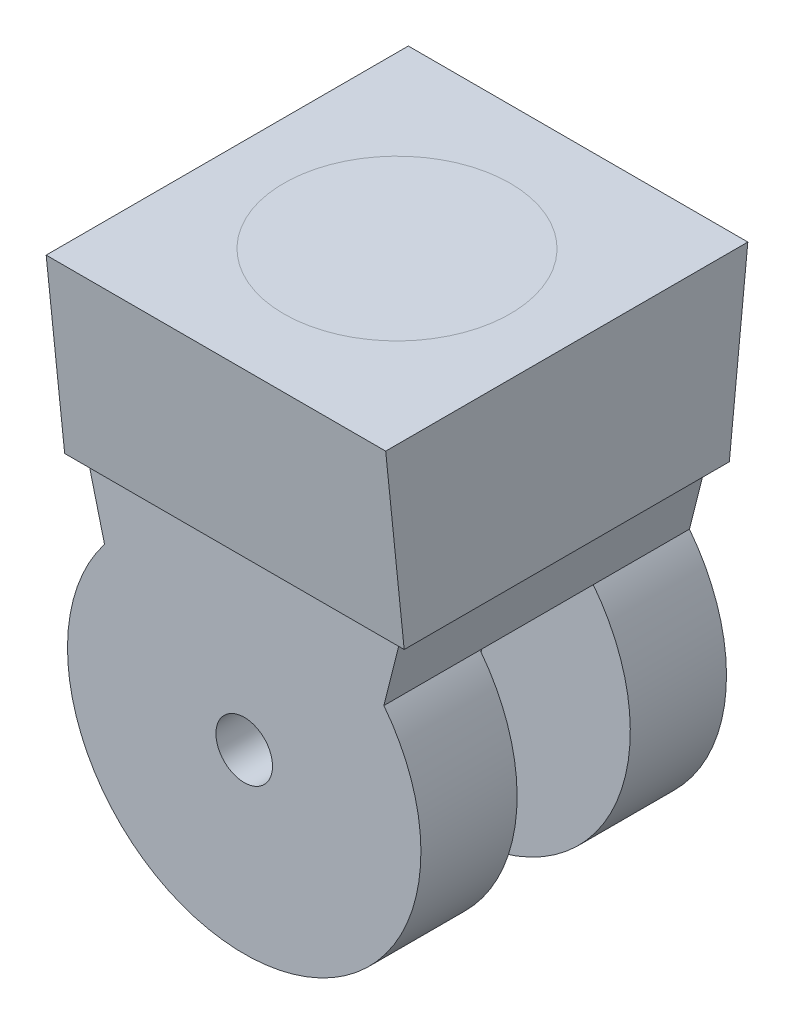
ISO-10303-21;
HEADER;
FILE_DESCRIPTION(('STEP AP214'),'2;1');
FILE_NAME('part.step','',(''),(''),'','','');
FILE_SCHEMA(('AUTOMOTIVE_DESIGN { 1 0 10303 214 1 1 1 1 }'));
ENDSEC;
DATA;
#1=APPLICATION_CONTEXT('core data for automotive mechanical design processes');
#2=APPLICATION_PROTOCOL_DEFINITION('international standard','automotive_design',2000,#1);
#3=PRODUCT_CONTEXT('',#1,'mechanical');
#4=PRODUCT('Part','Part','',(#3));
#5=PRODUCT_RELATED_PRODUCT_CATEGORY('part','',(#4));
#6=PRODUCT_DEFINITION_FORMATION('','',#4);
#7=PRODUCT_DEFINITION_CONTEXT('part definition',#1,'design');
#8=PRODUCT_DEFINITION('design','',#6,#7);
#9=PRODUCT_DEFINITION_SHAPE('','',#8);
#10=(LENGTH_UNIT() NAMED_UNIT(*) SI_UNIT(.MILLI.,.METRE.));
#11=(NAMED_UNIT(*) PLANE_ANGLE_UNIT() SI_UNIT($,.RADIAN.));
#12=(NAMED_UNIT(*) SI_UNIT($,.STERADIAN.) SOLID_ANGLE_UNIT());
#13=UNCERTAINTY_MEASURE_WITH_UNIT(LENGTH_MEASURE(1.E-05),#10,'distance_accuracy_value','');
#14=(GEOMETRIC_REPRESENTATION_CONTEXT(3) GLOBAL_UNCERTAINTY_ASSIGNED_CONTEXT((#13)) GLOBAL_UNIT_ASSIGNED_CONTEXT((#10,
#11,#12)) REPRESENTATION_CONTEXT('',''));
#15=CARTESIAN_POINT('',(0.,0.,0.));
#16=DIRECTION('',(0.,0.,1.));
#17=DIRECTION('',(1.,0.,0.));
#18=AXIS2_PLACEMENT_3D('',#15,#16,#17);
#19=CARTESIAN_POINT('',(38.1,20.319999994927,40.64));
#20=DIRECTION('',(0.,-1.,0.));
#21=DIRECTION('',(0.,0.,-1.));
#22=AXIS2_PLACEMENT_3D('',#19,#20,#21);
#23=PLANE('',#22);
#24=DIRECTION('',(0.,0.,1.));
#25=VECTOR('',#24,1.);
#26=CARTESIAN_POINT('',(-38.1,20.319999994927,40.64));
#27=LINE('',#26,#25);
#28=CARTESIAN_POINT('',(-38.1,20.319999994927,-40.64));
#29=VERTEX_POINT('',#28);
#30=CARTESIAN_POINT('',(-38.1,20.319999994927,40.64));
#31=VERTEX_POINT('',#30);
#32=EDGE_CURVE('E200',#29,#31,#27,.T.);
#33=ORIENTED_EDGE('',*,*,#32,.T.);
#34=DIRECTION('',(-1.,0.,0.));
#35=VECTOR('',#34,1.);
#36=CARTESIAN_POINT('',(38.1,20.319999994927,40.64));
#37=LINE('',#36,#35);
#38=CARTESIAN_POINT('',(38.1,20.319999994927,40.64));
#39=VERTEX_POINT('',#38);
#40=EDGE_CURVE('E188',#39,#31,#37,.T.);
#41=ORIENTED_EDGE('',*,*,#40,.F.);
#42=DIRECTION('',(0.,0.,1.));
#43=VECTOR('',#42,1.);
#44=CARTESIAN_POINT('',(38.1,20.319999994927,40.64));
#45=LINE('',#44,#43);
#46=CARTESIAN_POINT('',(38.1,20.319999994927,-40.64));
#47=VERTEX_POINT('',#46);
#48=EDGE_CURVE('E206',#47,#39,#45,.T.);
#49=ORIENTED_EDGE('',*,*,#48,.F.);
#50=DIRECTION('',(-1.,0.,0.));
#51=VECTOR('',#50,1.);
#52=CARTESIAN_POINT('',(38.1,20.319999994927,-40.64));
#53=LINE('',#52,#51);
#54=EDGE_CURVE('E185',#47,#29,#53,.T.);
#55=ORIENTED_EDGE('',*,*,#54,.T.);
#56=EDGE_LOOP('',(#33,#41,#49,#55));
#57=FACE_BOUND('',#56,.T.);
#58=CARTESIAN_POINT('',(0.,20.319999994927,0.));
#59=DIRECTION('',(0.,-1.,0.));
#60=DIRECTION('',(0.,0.,-1.));
#61=AXIS2_PLACEMENT_3D('',#58,#59,#60);
#62=CIRCLE('',#61,25.4);
#63=CARTESIAN_POINT('',(0.,20.319999994927,-25.4));
#64=VERTEX_POINT('',#63);
#65=EDGE_CURVE('E11',#64,#64,#62,.F.);
#66=ORIENTED_EDGE('',*,*,#65,.F.);
#67=EDGE_LOOP('',(#66));
#68=FACE_BOUND('',#67,.T.);
#69=ADVANCED_FACE('F35',(#57,#68),#23,.F.);
#70=CARTESIAN_POINT('',(0.,-59.9787578026609,34.29));
#71=DIRECTION('',(0.,0.,-1.));
#72=DIRECTION('',(-1.,0.,0.));
#73=AXIS2_PLACEMENT_3D('',#70,#71,#72);
#74=CYLINDRICAL_SURFACE('',#73,39.6587578077339);
#75=CARTESIAN_POINT('',(0.,-59.9787578026609,-12.7));
#76=DIRECTION('',(0.,0.,1.));
#77=DIRECTION('',(1.,0.,0.));
#78=AXIS2_PLACEMENT_3D('',#75,#76,#77);
#79=CIRCLE('',#78,39.6587578077339);
#80=CARTESIAN_POINT('',(-31.3489203017592,-35.6875604923914,-12.7));
#81=VERTEX_POINT('',#80);
#82=CARTESIAN_POINT('',(31.3489203017592,-35.6875604923914,-12.7));
#83=VERTEX_POINT('',#82);
#84=EDGE_CURVE('E126',#81,#83,#79,.T.);
#85=ORIENTED_EDGE('',*,*,#84,.F.);
#86=DIRECTION('',(0.,0.,-1.));
#87=VECTOR('',#86,1.);
#88=CARTESIAN_POINT('',(-31.3489203017592,-35.6875604923914,34.29));
#89=LINE('',#88,#87);
#90=CARTESIAN_POINT('',(-31.3489203017592,-35.6875604923914,-34.29));
#91=VERTEX_POINT('',#90);
#92=EDGE_CURVE('E141',#81,#91,#89,.T.);
#93=ORIENTED_EDGE('',*,*,#92,.T.);
#94=CARTESIAN_POINT('',(0.,-59.9787578026609,-34.29));
#95=DIRECTION('',(0.,0.,1.));
#96=DIRECTION('',(1.,0.,0.));
#97=AXIS2_PLACEMENT_3D('',#94,#95,#96);
#98=CIRCLE('',#97,39.6587578077339);
#99=CARTESIAN_POINT('',(31.3489203017592,-35.6875604923914,-34.29));
#100=VERTEX_POINT('',#99);
#101=EDGE_CURVE('E155',#91,#100,#98,.T.);
#102=ORIENTED_EDGE('',*,*,#101,.T.);
#103=DIRECTION('',(0.,0.,-1.));
#104=VECTOR('',#103,1.);
#105=CARTESIAN_POINT('',(31.3489203017592,-35.6875604923914,34.29));
#106=LINE('',#105,#104);
#107=EDGE_CURVE('E120',#83,#100,#106,.T.);
#108=ORIENTED_EDGE('',*,*,#107,.F.);
#109=EDGE_LOOP('',(#85,#93,#102,#108));
#110=FACE_BOUND('',#109,.T.);
#111=ADVANCED_FACE('F244',(#110),#74,.T.);
#112=CARTESIAN_POINT('',(38.1,20.319999994927,-40.64));
#113=DIRECTION('',(0.,0.101681793550419,0.994816974553797));
#114=DIRECTION('',(0.,-0.994816974553797,0.101681793550419));
#115=AXIS2_PLACEMENT_3D('',#112,#113,#114);
#116=PLANE('',#115);
#117=DIRECTION('',(0.,0.994816974553797,-0.101681793550419));
#118=VECTOR('',#117,1.);
#119=CARTESIAN_POINT('',(-38.1,20.319999994927,-40.64));
#120=LINE('',#119,#118);
#121=CARTESIAN_POINT('',(-38.1,-20.319999994927,-36.4861222571008));
#122=VERTEX_POINT('',#121);
#123=EDGE_CURVE('E202',#122,#29,#120,.T.);
#124=ORIENTED_EDGE('',*,*,#123,.T.);
#125=ORIENTED_EDGE('',*,*,#54,.F.);
#126=DIRECTION('',(0.,0.994816974553797,-0.101681793550419));
#127=VECTOR('',#126,1.);
#128=CARTESIAN_POINT('',(38.1,20.319999994927,-40.64));
#129=LINE('',#128,#127);
#130=CARTESIAN_POINT('',(38.1,-20.319999994927,-36.4861222571008));
#131=VERTEX_POINT('',#130);
#132=EDGE_CURVE('E208',#131,#47,#129,.T.);
#133=ORIENTED_EDGE('',*,*,#132,.F.);
#134=DIRECTION('',(-1.,0.,0.));
#135=VECTOR('',#134,1.);
#136=CARTESIAN_POINT('',(38.1,-20.319999994927,-36.4861222571008));
#137=LINE('',#136,#135);
#138=EDGE_CURVE('E44',#131,#122,#137,.T.);
#139=ORIENTED_EDGE('',*,*,#138,.T.);
#140=EDGE_LOOP('',(#124,#125,#133,#139));
#141=FACE_BOUND('',#140,.T.);
#142=ADVANCED_FACE('F37',(#141),#116,.F.);
#143=ORIENTED_EDGE('',*,*,#65,.T.);
#144=EDGE_LOOP('',(#143));
#145=FACE_BOUND('',#144,.T.);
#146=ADVANCED_FACE('F245',(#145),#23,.F.);
#147=CARTESIAN_POINT('',(38.1,20.319999994927,40.64));
#148=DIRECTION('',(0.,0.101681793550419,-0.994816974553797));
#149=DIRECTION('',(0.,0.994816974553797,0.101681793550419));
#150=AXIS2_PLACEMENT_3D('',#147,#148,#149);
#151=PLANE('',#150);
#152=DIRECTION('',(0.,-0.994816974553797,-0.101681793550419));
#153=VECTOR('',#152,1.);
#154=CARTESIAN_POINT('',(-38.1,20.319999994927,40.64));
#155=LINE('',#154,#153);
#156=CARTESIAN_POINT('',(-38.1,-20.319999994927,36.4861222571008));
#157=VERTEX_POINT('',#156);
#158=EDGE_CURVE('E198',#31,#157,#155,.T.);
#159=ORIENTED_EDGE('',*,*,#158,.T.);
#160=DIRECTION('',(-1.,0.,0.));
#161=VECTOR('',#160,1.);
#162=CARTESIAN_POINT('',(38.1,-20.319999994927,36.4861222571008));
#163=LINE('',#162,#161);
#164=CARTESIAN_POINT('',(38.1,-20.319999994927,36.4861222571008));
#165=VERTEX_POINT('',#164);
#166=EDGE_CURVE('E191',#165,#157,#163,.T.);
#167=ORIENTED_EDGE('',*,*,#166,.F.);
#168=DIRECTION('',(0.,-0.994816974553797,-0.101681793550419));
#169=VECTOR('',#168,1.);
#170=CARTESIAN_POINT('',(38.1,20.319999994927,40.64));
#171=LINE('',#170,#169);
#172=EDGE_CURVE('E194',#39,#165,#171,.T.);
#173=ORIENTED_EDGE('',*,*,#172,.F.);
#174=ORIENTED_EDGE('',*,*,#40,.T.);
#175=EDGE_LOOP('',(#159,#167,#173,#174));
#176=FACE_BOUND('',#175,.T.);
#177=ADVANCED_FACE('F229',(#176),#151,.F.);
#178=CARTESIAN_POINT('',(38.1,-20.319999994927,36.4861222571008));
#179=DIRECTION('',(0.,1.,0.));
#180=DIRECTION('',(0.,0.,1.));
#181=AXIS2_PLACEMENT_3D('',#178,#179,#180);
#182=PLANE('',#181);
#183=DIRECTION('',(0.,0.,-1.));
#184=VECTOR('',#183,1.);
#185=CARTESIAN_POINT('',(-35.2236647465318,-20.319999994927,34.29));
#186=LINE('',#185,#184);
#187=CARTESIAN_POINT('',(-35.2236647465318,-20.319999994927,34.29));
#188=VERTEX_POINT('',#187);
#189=CARTESIAN_POINT('',(-35.2236647465318,-20.319999994927,-34.29));
#190=VERTEX_POINT('',#189);
#191=EDGE_CURVE('E59',#188,#190,#186,.T.);
#192=ORIENTED_EDGE('',*,*,#191,.F.);
#193=DIRECTION('',(-1.,0.,0.));
#194=VECTOR('',#193,1.);
#195=CARTESIAN_POINT('',(-35.2236647465318,-20.319999994927,34.29));
#196=LINE('',#195,#194);
#197=CARTESIAN_POINT('',(35.2236647465318,-20.319999994927,34.29));
#198=VERTEX_POINT('',#197);
#199=EDGE_CURVE('E147',#198,#188,#196,.T.);
#200=ORIENTED_EDGE('',*,*,#199,.F.);
#201=DIRECTION('',(0.,0.,-1.));
#202=VECTOR('',#201,1.);
#203=CARTESIAN_POINT('',(35.2236647465318,-20.319999994927,34.29));
#204=LINE('',#203,#202);
#205=CARTESIAN_POINT('',(35.2236647465318,-20.319999994927,-34.29));
#206=VERTEX_POINT('',#205);
#207=EDGE_CURVE('E144',#198,#206,#204,.T.);
#208=ORIENTED_EDGE('',*,*,#207,.T.);
#209=DIRECTION('',(-1.,0.,0.));
#210=VECTOR('',#209,1.);
#211=CARTESIAN_POINT('',(-35.2236647465318,-20.319999994927,-34.29));
#212=LINE('',#211,#210);
#213=EDGE_CURVE('E150',#206,#190,#212,.T.);
#214=ORIENTED_EDGE('',*,*,#213,.T.);
#215=EDGE_LOOP('',(#192,#200,#208,#214));
#216=FACE_BOUND('',#215,.T.);
#217=DIRECTION('',(0.,0.,-1.));
#218=VECTOR('',#217,1.);
#219=CARTESIAN_POINT('',(-38.1,-20.319999994927,36.4861222571008));
#220=LINE('',#219,#218);
#221=EDGE_CURVE('E195',#157,#122,#220,.T.);
#222=ORIENTED_EDGE('',*,*,#221,.T.);
#223=ORIENTED_EDGE('',*,*,#138,.F.);
#224=DIRECTION('',(0.,0.,-1.));
#225=VECTOR('',#224,1.);
#226=CARTESIAN_POINT('',(38.1,-20.319999994927,-36.4861222571008));
#227=LINE('',#226,#225);
#228=EDGE_CURVE('E197',#165,#131,#227,.T.);
#229=ORIENTED_EDGE('',*,*,#228,.F.);
#230=ORIENTED_EDGE('',*,*,#166,.T.);
#231=EDGE_LOOP('',(#222,#223,#229,#230));
#232=FACE_BOUND('',#231,.T.);
#233=ADVANCED_FACE('F218',(#216,#232),#182,.F.);
#234=CARTESIAN_POINT('',(38.1,0.,0.));
#235=DIRECTION('',(1.,0.,0.));
#236=DIRECTION('',(0.,0.,-1.));
#237=AXIS2_PLACEMENT_3D('',#234,#235,#236);
#238=PLANE('',#237);
#239=ORIENTED_EDGE('',*,*,#228,.T.);
#240=ORIENTED_EDGE('',*,*,#132,.T.);
#241=ORIENTED_EDGE('',*,*,#48,.T.);
#242=ORIENTED_EDGE('',*,*,#172,.T.);
#243=EDGE_LOOP('',(#239,#240,#241,#242));
#244=FACE_BOUND('',#243,.T.);
#245=ADVANCED_FACE('F213',(#244),#238,.T.);
#246=CARTESIAN_POINT('',(-38.1,0.,0.));
#247=DIRECTION('',(1.,0.,0.));
#248=DIRECTION('',(0.,0.,-1.));
#249=AXIS2_PLACEMENT_3D('',#246,#247,#248);
#250=PLANE('',#249);
#251=ORIENTED_EDGE('',*,*,#123,.F.);
#252=ORIENTED_EDGE('',*,*,#221,.F.);
#253=ORIENTED_EDGE('',*,*,#158,.F.);
#254=ORIENTED_EDGE('',*,*,#32,.F.);
#255=EDGE_LOOP('',(#251,#252,#253,#254));
#256=FACE_BOUND('',#255,.T.);
#257=ADVANCED_FACE('F231',(#256),#250,.F.);
#258=CARTESIAN_POINT('',(-35.2236647465318,-20.319999994927,34.29));
#259=DIRECTION('',(0.969652768454366,0.244486213576111,0.));
#260=DIRECTION('',(-0.244486213576111,0.969652768454366,0.));
#261=AXIS2_PLACEMENT_3D('',#258,#259,#260);
#262=PLANE('',#261);
#263=DIRECTION('',(0.244486213576111,-0.969652768454366,0.));
#264=VECTOR('',#263,1.);
#265=CARTESIAN_POINT('',(-35.2236647465318,-20.319999994927,-34.29));
#266=LINE('',#265,#264);
#267=EDGE_CURVE('E157',#190,#91,#266,.T.);
#268=ORIENTED_EDGE('',*,*,#267,.T.);
#269=ORIENTED_EDGE('',*,*,#92,.F.);
#270=DIRECTION('',(0.,0.,1.));
#271=VECTOR('',#270,1.);
#272=CARTESIAN_POINT('',(-31.3489203017592,-35.6875604923914,-12.7));
#273=LINE('',#272,#271);
#274=CARTESIAN_POINT('',(-31.3489203017592,-35.6875604923914,12.7));
#275=VERTEX_POINT('',#274);
#276=EDGE_CURVE('E160',#81,#275,#273,.T.);
#277=ORIENTED_EDGE('',*,*,#276,.T.);
#278=CARTESIAN_POINT('',(-31.3489203017592,-35.6875604923914,34.29));
#279=VERTEX_POINT('',#278);
#280=EDGE_CURVE('E134',#279,#275,#89,.T.);
#281=ORIENTED_EDGE('',*,*,#280,.F.);
#282=DIRECTION('',(0.244486213576111,-0.969652768454366,0.));
#283=VECTOR('',#282,1.);
#284=CARTESIAN_POINT('',(-35.2236647465318,-20.319999994927,34.29));
#285=LINE('',#284,#283);
#286=EDGE_CURVE('E152',#188,#279,#285,.T.);
#287=ORIENTED_EDGE('',*,*,#286,.F.);
#288=ORIENTED_EDGE('',*,*,#191,.T.);
#289=EDGE_LOOP('',(#268,#269,#277,#281,#287,#288));
#290=FACE_BOUND('',#289,.T.);
#291=ADVANCED_FACE('F233',(#290),#262,.F.);
#292=ORIENTED_EDGE('',*,*,#280,.T.);
#293=CARTESIAN_POINT('',(0.,-59.9787578026609,12.7));
#294=DIRECTION('',(0.,0.,1.));
#295=DIRECTION('',(1.,0.,0.));
#296=AXIS2_PLACEMENT_3D('',#293,#294,#295);
#297=CIRCLE('',#296,39.6587578077339);
#298=CARTESIAN_POINT('',(31.3489203017592,-35.6875604923914,12.7));
#299=VERTEX_POINT('',#298);
#300=EDGE_CURVE('E125',#275,#299,#297,.T.);
#301=ORIENTED_EDGE('',*,*,#300,.T.);
#302=CARTESIAN_POINT('',(31.3489203017592,-35.6875604923914,34.29));
#303=VERTEX_POINT('',#302);
#304=EDGE_CURVE('E119',#303,#299,#106,.T.);
#305=ORIENTED_EDGE('',*,*,#304,.F.);
#306=CARTESIAN_POINT('',(0.,-59.9787578026609,34.29));
#307=DIRECTION('',(0.,0.,1.));
#308=DIRECTION('',(1.,0.,0.));
#309=AXIS2_PLACEMENT_3D('',#306,#307,#308);
#310=CIRCLE('',#309,39.6587578077339);
#311=EDGE_CURVE('E163',#279,#303,#310,.T.);
#312=ORIENTED_EDGE('',*,*,#311,.F.);
#313=EDGE_LOOP('',(#292,#301,#305,#312));
#314=FACE_BOUND('',#313,.T.);
#315=ADVANCED_FACE('F131',(#314),#74,.T.);
#316=CARTESIAN_POINT('',(35.2236647465318,-20.319999994927,34.29));
#317=DIRECTION('',(-0.969652768454366,0.244486213576111,0.));
#318=DIRECTION('',(-0.244486213576111,-0.969652768454366,0.));
#319=AXIS2_PLACEMENT_3D('',#316,#317,#318);
#320=PLANE('',#319);
#321=DIRECTION('',(0.244486213576111,0.969652768454366,0.));
#322=VECTOR('',#321,1.);
#323=CARTESIAN_POINT('',(35.2236647465318,-20.319999994927,-34.29));
#324=LINE('',#323,#322);
#325=EDGE_CURVE('E153',#100,#206,#324,.T.);
#326=ORIENTED_EDGE('',*,*,#325,.T.);
#327=ORIENTED_EDGE('',*,*,#207,.F.);
#328=DIRECTION('',(0.244486213576111,0.969652768454366,0.));
#329=VECTOR('',#328,1.);
#330=CARTESIAN_POINT('',(35.2236647465318,-20.319999994927,34.29));
#331=LINE('',#330,#329);
#332=EDGE_CURVE('E140',#303,#198,#331,.T.);
#333=ORIENTED_EDGE('',*,*,#332,.F.);
#334=ORIENTED_EDGE('',*,*,#304,.T.);
#335=EDGE_CURVE('E112',#299,#83,#106,.T.);
#336=ORIENTED_EDGE('',*,*,#335,.T.);
#337=ORIENTED_EDGE('',*,*,#107,.T.);
#338=EDGE_LOOP('',(#326,#327,#333,#334,#336,#337));
#339=FACE_BOUND('',#338,.T.);
#340=ADVANCED_FACE('F137',(#339),#320,.F.);
#341=CARTESIAN_POINT('',(0.,-59.9787578026609,34.29));
#342=DIRECTION('',(0.,0.,1.));
#343=DIRECTION('',(1.,0.,0.));
#344=AXIS2_PLACEMENT_3D('',#341,#342,#343);
#345=PLANE('',#344);
#346=CARTESIAN_POINT('',(0.,-59.9787578026609,34.29));
#347=DIRECTION('',(0.,0.,1.));
#348=DIRECTION('',(1.,0.,0.));
#349=AXIS2_PLACEMENT_3D('',#346,#347,#348);
#350=CIRCLE('',#349,6.35);
#351=CARTESIAN_POINT('',(6.35,-59.9787578026609,34.29));
#352=VERTEX_POINT('',#351);
#353=EDGE_CURVE('E175',#352,#352,#350,.T.);
#354=ORIENTED_EDGE('',*,*,#353,.F.);
#355=EDGE_LOOP('',(#354));
#356=FACE_BOUND('',#355,.T.);
#357=ORIENTED_EDGE('',*,*,#286,.T.);
#358=ORIENTED_EDGE('',*,*,#311,.T.);
#359=ORIENTED_EDGE('',*,*,#332,.T.);
#360=ORIENTED_EDGE('',*,*,#199,.T.);
#361=EDGE_LOOP('',(#357,#358,#359,#360));
#362=FACE_BOUND('',#361,.T.);
#363=ADVANCED_FACE('F295',(#356,#362),#345,.T.);
#364=CARTESIAN_POINT('',(0.,-59.9787578026609,-34.29));
#365=DIRECTION('',(0.,0.,1.));
#366=DIRECTION('',(1.,0.,0.));
#367=AXIS2_PLACEMENT_3D('',#364,#365,#366);
#368=PLANE('',#367);
#369=CARTESIAN_POINT('',(0.,-59.9787578026609,-34.29));
#370=DIRECTION('',(0.,0.,1.));
#371=DIRECTION('',(1.,0.,0.));
#372=AXIS2_PLACEMENT_3D('',#369,#370,#371);
#373=CIRCLE('',#372,6.35);
#374=CARTESIAN_POINT('',(6.35,-59.9787578026609,-34.29));
#375=VERTEX_POINT('',#374);
#376=EDGE_CURVE('E135',#375,#375,#373,.T.);
#377=ORIENTED_EDGE('',*,*,#376,.T.);
#378=EDGE_LOOP('',(#377));
#379=FACE_BOUND('',#378,.T.);
#380=ORIENTED_EDGE('',*,*,#267,.F.);
#381=ORIENTED_EDGE('',*,*,#213,.F.);
#382=ORIENTED_EDGE('',*,*,#325,.F.);
#383=ORIENTED_EDGE('',*,*,#101,.F.);
#384=EDGE_LOOP('',(#380,#381,#382,#383));
#385=FACE_BOUND('',#384,.T.);
#386=ADVANCED_FACE('F306',(#379,#385),#368,.F.);
#387=CARTESIAN_POINT('',(0.,-59.9787578026609,-12.7));
#388=DIRECTION('',(0.,0.,1.));
#389=DIRECTION('',(1.,0.,0.));
#390=AXIS2_PLACEMENT_3D('',#387,#388,#389);
#391=CYLINDRICAL_SURFACE('',#390,39.6587578077339);
#392=EDGE_CURVE('E51',#83,#81,#79,.T.);
#393=ORIENTED_EDGE('',*,*,#392,.F.);
#394=ORIENTED_EDGE('',*,*,#335,.F.);
#395=EDGE_CURVE('E115',#299,#275,#297,.T.);
#396=ORIENTED_EDGE('',*,*,#395,.T.);
#397=ORIENTED_EDGE('',*,*,#276,.F.);
#398=EDGE_LOOP('',(#393,#394,#396,#397));
#399=FACE_BOUND('',#398,.T.);
#400=ADVANCED_FACE('F114',(#399),#391,.F.);
#401=CARTESIAN_POINT('',(0.,-59.9787578026609,-12.7));
#402=DIRECTION('',(0.,0.,1.));
#403=DIRECTION('',(1.,0.,0.));
#404=AXIS2_PLACEMENT_3D('',#401,#402,#403);
#405=PLANE('',#404);
#406=CARTESIAN_POINT('',(0.,-59.9787578026609,-12.7));
#407=DIRECTION('',(0.,0.,1.));
#408=DIRECTION('',(1.,0.,0.));
#409=AXIS2_PLACEMENT_3D('',#406,#407,#408);
#410=CIRCLE('',#409,6.35);
#411=CARTESIAN_POINT('',(6.35,-59.9787578026609,-12.7));
#412=VERTEX_POINT('',#411);
#413=EDGE_CURVE('E171',#412,#412,#410,.T.);
#414=ORIENTED_EDGE('',*,*,#413,.F.);
#415=EDGE_LOOP('',(#414));
#416=FACE_BOUND('',#415,.T.);
#417=ORIENTED_EDGE('',*,*,#392,.T.);
#418=ORIENTED_EDGE('',*,*,#84,.T.);
#419=EDGE_LOOP('',(#417,#418));
#420=FACE_BOUND('',#419,.T.);
#421=ADVANCED_FACE('F305',(#416,#420),#405,.T.);
#422=CARTESIAN_POINT('',(0.,-59.9787578026609,12.7));
#423=DIRECTION('',(0.,0.,1.));
#424=DIRECTION('',(1.,0.,0.));
#425=AXIS2_PLACEMENT_3D('',#422,#423,#424);
#426=PLANE('',#425);
#427=CARTESIAN_POINT('',(0.,-59.9787578026609,12.7));
#428=DIRECTION('',(0.,0.,1.));
#429=DIRECTION('',(1.,0.,0.));
#430=AXIS2_PLACEMENT_3D('',#427,#428,#429);
#431=CIRCLE('',#430,6.35);
#432=CARTESIAN_POINT('',(6.35,-59.9787578026609,12.7));
#433=VERTEX_POINT('',#432);
#434=EDGE_CURVE('E174',#433,#433,#431,.T.);
#435=ORIENTED_EDGE('',*,*,#434,.T.);
#436=EDGE_LOOP('',(#435));
#437=FACE_BOUND('',#436,.T.);
#438=ORIENTED_EDGE('',*,*,#395,.F.);
#439=ORIENTED_EDGE('',*,*,#300,.F.);
#440=EDGE_LOOP('',(#438,#439));
#441=FACE_BOUND('',#440,.T.);
#442=ADVANCED_FACE('F124',(#437,#441),#426,.F.);
#443=CARTESIAN_POINT('',(0.,-59.9787578026609,-40.64));
#444=DIRECTION('',(0.,0.,1.));
#445=DIRECTION('',(1.,0.,0.));
#446=AXIS2_PLACEMENT_3D('',#443,#444,#445);
#447=CYLINDRICAL_SURFACE('',#446,6.35);
#448=ORIENTED_EDGE('',*,*,#353,.T.);
#449=EDGE_LOOP('',(#448));
#450=FACE_BOUND('',#449,.T.);
#451=ORIENTED_EDGE('',*,*,#434,.F.);
#452=EDGE_LOOP('',(#451));
#453=FACE_BOUND('',#452,.T.);
#454=ADVANCED_FACE('F339',(#450,#453),#447,.F.);
#455=ORIENTED_EDGE('',*,*,#413,.T.);
#456=EDGE_LOOP('',(#455));
#457=FACE_BOUND('',#456,.T.);
#458=ORIENTED_EDGE('',*,*,#376,.F.);
#459=EDGE_LOOP('',(#458));
#460=FACE_BOUND('',#459,.T.);
#461=ADVANCED_FACE('F348',(#457,#460),#447,.F.);
#462=CLOSED_SHELL('',(#69,#111,#142,#146,#177,#233,#245,#257,#291,#315,#340,#363,#386,#400,#421,
#442,#454,#461));
#463=MANIFOLD_SOLID_BREP('B2',#462);
#464=ADVANCED_BREP_SHAPE_REPRESENTATION('',(#18,#463),#14);
#465=SHAPE_DEFINITION_REPRESENTATION(#9,#464);
ENDSEC;
END-ISO-10303-21;
